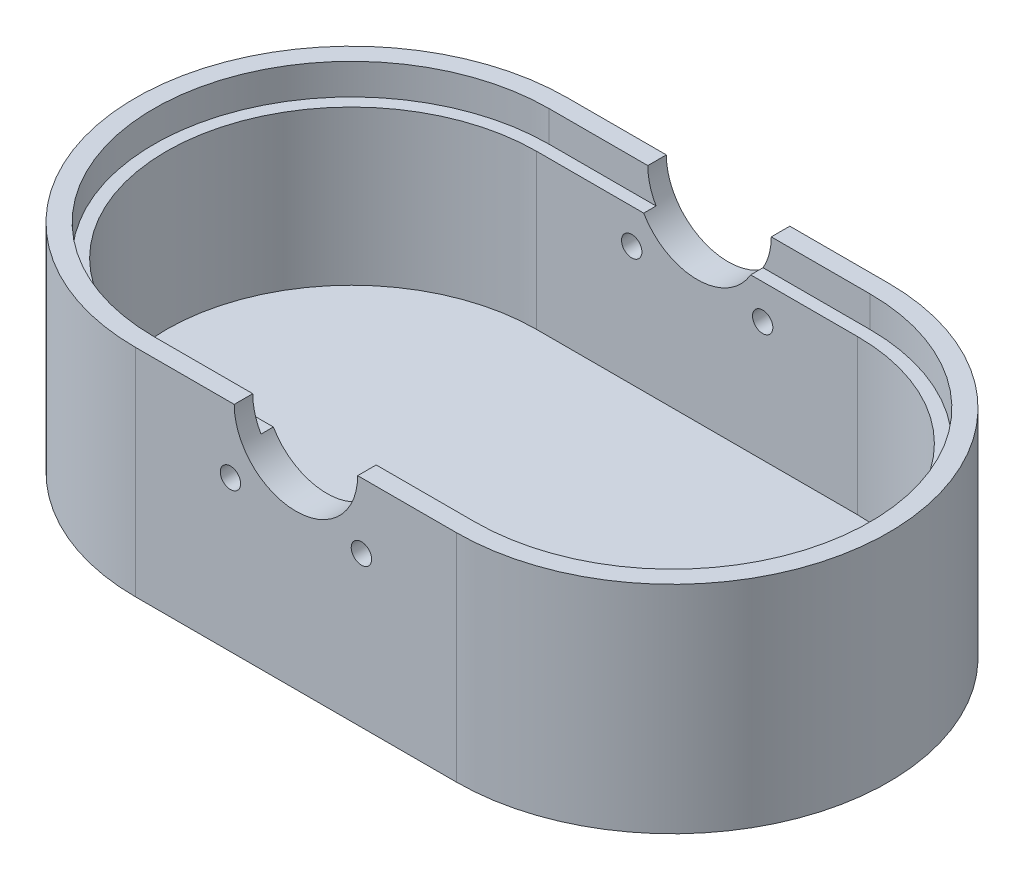
ISO-10303-21;
HEADER;
FILE_DESCRIPTION(('STEP AP214'),'2;1');
FILE_NAME('part.step','',(''),(''),'','','');
FILE_SCHEMA(('AUTOMOTIVE_DESIGN { 1 0 10303 214 1 1 1 1 }'));
ENDSEC;
DATA;
#1=APPLICATION_CONTEXT('core data for automotive mechanical design processes');
#2=APPLICATION_PROTOCOL_DEFINITION('international standard','automotive_design',2000,#1);
#3=PRODUCT_CONTEXT('',#1,'mechanical');
#4=PRODUCT('Part','Part','',(#3));
#5=PRODUCT_RELATED_PRODUCT_CATEGORY('part','',(#4));
#6=PRODUCT_DEFINITION_FORMATION('','',#4);
#7=PRODUCT_DEFINITION_CONTEXT('part definition',#1,'design');
#8=PRODUCT_DEFINITION('design','',#6,#7);
#9=PRODUCT_DEFINITION_SHAPE('','',#8);
#10=(LENGTH_UNIT() NAMED_UNIT(*) SI_UNIT(.MILLI.,.METRE.));
#11=(NAMED_UNIT(*) PLANE_ANGLE_UNIT() SI_UNIT($,.RADIAN.));
#12=(NAMED_UNIT(*) SI_UNIT($,.STERADIAN.) SOLID_ANGLE_UNIT());
#13=UNCERTAINTY_MEASURE_WITH_UNIT(LENGTH_MEASURE(1.E-05),#10,'distance_accuracy_value','');
#14=(GEOMETRIC_REPRESENTATION_CONTEXT(3) GLOBAL_UNCERTAINTY_ASSIGNED_CONTEXT((#13)) GLOBAL_UNIT_ASSIGNED_CONTEXT((#10,
#11,#12)) REPRESENTATION_CONTEXT('',''));
#15=CARTESIAN_POINT('',(0.,0.,0.));
#16=DIRECTION('',(0.,0.,1.));
#17=DIRECTION('',(1.,0.,0.));
#18=AXIS2_PLACEMENT_3D('',#15,#16,#17);
#19=CARTESIAN_POINT('',(26.,5.,0.));
#20=DIRECTION('',(0.,1.,0.));
#21=DIRECTION('',(0.,0.,1.));
#22=AXIS2_PLACEMENT_3D('',#19,#20,#21);
#23=CYLINDRICAL_SURFACE('',#22,30.);
#24=CARTESIAN_POINT('',(26.,30.,0.));
#25=DIRECTION('',(0.,1.,0.));
#26=DIRECTION('',(0.,0.,1.));
#27=AXIS2_PLACEMENT_3D('',#24,#25,#26);
#28=CIRCLE('',#27,30.);
#29=CARTESIAN_POINT('',(26.,30.,30.));
#30=VERTEX_POINT('',#29);
#31=CARTESIAN_POINT('',(26.,30.,-30.));
#32=VERTEX_POINT('',#31);
#33=EDGE_CURVE('E182',#30,#32,#28,.T.);
#34=ORIENTED_EDGE('',*,*,#33,.T.);
#35=DIRECTION('',(0.,1.,0.));
#36=VECTOR('',#35,1.);
#37=CARTESIAN_POINT('',(26.,5.,-30.));
#38=LINE('',#37,#36);
#39=CARTESIAN_POINT('',(26.,5.,-30.));
#40=VERTEX_POINT('',#39);
#41=EDGE_CURVE('E202',#40,#32,#38,.T.);
#42=ORIENTED_EDGE('',*,*,#41,.F.);
#43=CARTESIAN_POINT('',(26.,5.,0.));
#44=DIRECTION('',(0.,1.,0.));
#45=DIRECTION('',(0.,0.,1.));
#46=AXIS2_PLACEMENT_3D('',#43,#44,#45);
#47=CIRCLE('',#46,30.);
#48=CARTESIAN_POINT('',(26.,5.,30.));
#49=VERTEX_POINT('',#48);
#50=EDGE_CURVE('E286',#49,#40,#47,.T.);
#51=ORIENTED_EDGE('',*,*,#50,.F.);
#52=DIRECTION('',(0.,1.,0.));
#53=VECTOR('',#52,1.);
#54=CARTESIAN_POINT('',(26.,5.,30.));
#55=LINE('',#54,#53);
#56=EDGE_CURVE('E197',#49,#30,#55,.T.);
#57=ORIENTED_EDGE('',*,*,#56,.T.);
#58=EDGE_LOOP('',(#34,#42,#51,#57));
#59=FACE_BOUND('',#58,.T.);
#60=ADVANCED_FACE('F35',(#59),#23,.F.);
#61=CARTESIAN_POINT('',(-26.,5.,30.));
#62=DIRECTION('',(0.,0.,1.));
#63=DIRECTION('',(1.,0.,0.));
#64=AXIS2_PLACEMENT_3D('',#61,#62,#63);
#65=PLANE('',#64);
#66=CARTESIAN_POINT('',(-10.6066017177982,24.3933982822018,30.));
#67=DIRECTION('',(0.,0.,1.));
#68=DIRECTION('',(1.,0.,0.));
#69=AXIS2_PLACEMENT_3D('',#66,#67,#68);
#70=CIRCLE('',#69,1.64999999999999);
#71=CARTESIAN_POINT('',(-8.9566017177982,24.3933982822018,30.));
#72=VERTEX_POINT('',#71);
#73=EDGE_CURVE('E434',#72,#72,#70,.T.);
#74=ORIENTED_EDGE('',*,*,#73,.T.);
#75=EDGE_LOOP('',(#74));
#76=FACE_BOUND('',#75,.T.);
#77=CARTESIAN_POINT('',(10.6066017177982,24.3933982822018,30.));
#78=DIRECTION('',(0.,0.,1.));
#79=DIRECTION('',(1.,0.,0.));
#80=AXIS2_PLACEMENT_3D('',#77,#78,#79);
#81=CIRCLE('',#80,1.64999999999999);
#82=CARTESIAN_POINT('',(12.2566017177982,24.3933982822018,30.));
#83=VERTEX_POINT('',#82);
#84=EDGE_CURVE('E191',#83,#83,#81,.T.);
#85=ORIENTED_EDGE('',*,*,#84,.T.);
#86=EDGE_LOOP('',(#85));
#87=FACE_BOUND('',#86,.T.);
#88=DIRECTION('',(1.,0.,0.));
#89=VECTOR('',#88,1.);
#90=CARTESIAN_POINT('',(-26.,30.,30.));
#91=LINE('',#90,#89);
#92=CARTESIAN_POINT('',(8.66025403784438,30.,30.));
#93=VERTEX_POINT('',#92);
#94=EDGE_CURVE('E58',#93,#30,#91,.T.);
#95=ORIENTED_EDGE('',*,*,#94,.T.);
#96=ORIENTED_EDGE('',*,*,#56,.F.);
#97=DIRECTION('',(1.,0.,0.));
#98=VECTOR('',#97,1.);
#99=CARTESIAN_POINT('',(-26.,5.,30.));
#100=LINE('',#99,#98);
#101=CARTESIAN_POINT('',(-26.,5.,30.));
#102=VERTEX_POINT('',#101);
#103=EDGE_CURVE('E196',#102,#49,#100,.T.);
#104=ORIENTED_EDGE('',*,*,#103,.F.);
#105=DIRECTION('',(0.,1.,0.));
#106=VECTOR('',#105,1.);
#107=CARTESIAN_POINT('',(-26.,5.,30.));
#108=LINE('',#107,#106);
#109=CARTESIAN_POINT('',(-26.,30.,30.));
#110=VERTEX_POINT('',#109);
#111=EDGE_CURVE('E188',#102,#110,#108,.T.);
#112=ORIENTED_EDGE('',*,*,#111,.T.);
#113=CARTESIAN_POINT('',(-8.66025403784438,30.,30.));
#114=VERTEX_POINT('',#113);
#115=EDGE_CURVE('E171',#110,#114,#91,.T.);
#116=ORIENTED_EDGE('',*,*,#115,.T.);
#117=CARTESIAN_POINT('',(0.,35.,30.));
#118=DIRECTION('',(0.,0.,1.));
#119=DIRECTION('',(1.,0.,0.));
#120=AXIS2_PLACEMENT_3D('',#117,#118,#119);
#121=CIRCLE('',#120,10.);
#122=EDGE_CURVE('E274',#114,#93,#121,.T.);
#123=ORIENTED_EDGE('',*,*,#122,.T.);
#124=EDGE_LOOP('',(#95,#96,#104,#112,#116,#123));
#125=FACE_BOUND('',#124,.T.);
#126=ADVANCED_FACE('F194',(#76,#87,#125),#65,.F.);
#127=CARTESIAN_POINT('',(-26.,5.,0.));
#128=DIRECTION('',(0.,1.,0.));
#129=DIRECTION('',(0.,0.,1.));
#130=AXIS2_PLACEMENT_3D('',#127,#128,#129);
#131=CYLINDRICAL_SURFACE('',#130,30.);
#132=CARTESIAN_POINT('',(-26.,30.,0.));
#133=DIRECTION('',(0.,1.,0.));
#134=DIRECTION('',(0.,0.,1.));
#135=AXIS2_PLACEMENT_3D('',#132,#133,#134);
#136=CIRCLE('',#135,30.);
#137=CARTESIAN_POINT('',(-26.,30.,-30.));
#138=VERTEX_POINT('',#137);
#139=EDGE_CURVE('E174',#138,#110,#136,.T.);
#140=ORIENTED_EDGE('',*,*,#139,.T.);
#141=ORIENTED_EDGE('',*,*,#111,.F.);
#142=CARTESIAN_POINT('',(-26.,5.,0.));
#143=DIRECTION('',(0.,1.,0.));
#144=DIRECTION('',(0.,0.,1.));
#145=AXIS2_PLACEMENT_3D('',#142,#143,#144);
#146=CIRCLE('',#145,30.);
#147=CARTESIAN_POINT('',(-26.,5.,-30.));
#148=VERTEX_POINT('',#147);
#149=EDGE_CURVE('E292',#148,#102,#146,.T.);
#150=ORIENTED_EDGE('',*,*,#149,.F.);
#151=DIRECTION('',(0.,1.,0.));
#152=VECTOR('',#151,1.);
#153=CARTESIAN_POINT('',(-26.,5.,-30.));
#154=LINE('',#153,#152);
#155=EDGE_CURVE('E190',#148,#138,#154,.T.);
#156=ORIENTED_EDGE('',*,*,#155,.T.);
#157=EDGE_LOOP('',(#140,#141,#150,#156));
#158=FACE_BOUND('',#157,.T.);
#159=ADVANCED_FACE('F186',(#158),#131,.F.);
#160=CARTESIAN_POINT('',(26.,5.,-30.));
#161=DIRECTION('',(0.,0.,-1.));
#162=DIRECTION('',(-1.,0.,0.));
#163=AXIS2_PLACEMENT_3D('',#160,#161,#162);
#164=PLANE('',#163);
#165=CARTESIAN_POINT('',(10.6066017177982,24.3933982822018,-30.));
#166=DIRECTION('',(0.,0.,-1.));
#167=DIRECTION('',(-1.,0.,0.));
#168=AXIS2_PLACEMENT_3D('',#165,#166,#167);
#169=CIRCLE('',#168,1.64999999999999);
#170=CARTESIAN_POINT('',(8.95660171779824,24.3933982822018,-30.));
#171=VERTEX_POINT('',#170);
#172=EDGE_CURVE('E423',#171,#171,#169,.T.);
#173=ORIENTED_EDGE('',*,*,#172,.T.);
#174=EDGE_LOOP('',(#173));
#175=FACE_BOUND('',#174,.T.);
#176=CARTESIAN_POINT('',(-10.6066017177982,24.3933982822018,-30.));
#177=DIRECTION('',(0.,0.,-1.));
#178=DIRECTION('',(-1.,0.,0.));
#179=AXIS2_PLACEMENT_3D('',#176,#177,#178);
#180=CIRCLE('',#179,1.64999999999999);
#181=CARTESIAN_POINT('',(-12.2566017177982,24.3933982822018,-30.));
#182=VERTEX_POINT('',#181);
#183=EDGE_CURVE('E422',#182,#182,#180,.T.);
#184=ORIENTED_EDGE('',*,*,#183,.T.);
#185=EDGE_LOOP('',(#184));
#186=FACE_BOUND('',#185,.T.);
#187=DIRECTION('',(-1.,0.,0.));
#188=VECTOR('',#187,1.);
#189=CARTESIAN_POINT('',(26.,30.,-30.));
#190=LINE('',#189,#188);
#191=CARTESIAN_POINT('',(-8.66025403784438,30.,-30.));
#192=VERTEX_POINT('',#191);
#193=EDGE_CURVE('E300',#192,#138,#190,.T.);
#194=ORIENTED_EDGE('',*,*,#193,.T.);
#195=ORIENTED_EDGE('',*,*,#155,.F.);
#196=DIRECTION('',(-1.,0.,0.));
#197=VECTOR('',#196,1.);
#198=CARTESIAN_POINT('',(26.,5.,-30.));
#199=LINE('',#198,#197);
#200=EDGE_CURVE('E289',#40,#148,#199,.T.);
#201=ORIENTED_EDGE('',*,*,#200,.F.);
#202=ORIENTED_EDGE('',*,*,#41,.T.);
#203=CARTESIAN_POINT('',(8.66025403784438,30.,-30.));
#204=VERTEX_POINT('',#203);
#205=EDGE_CURVE('E302',#32,#204,#190,.T.);
#206=ORIENTED_EDGE('',*,*,#205,.T.);
#207=CARTESIAN_POINT('',(0.,35.,-30.));
#208=DIRECTION('',(0.,0.,-1.));
#209=DIRECTION('',(-1.,0.,0.));
#210=AXIS2_PLACEMENT_3D('',#207,#208,#209);
#211=CIRCLE('',#210,10.);
#212=EDGE_CURVE('E241',#204,#192,#211,.T.);
#213=ORIENTED_EDGE('',*,*,#212,.T.);
#214=EDGE_LOOP('',(#194,#195,#201,#202,#206,#213));
#215=FACE_BOUND('',#214,.T.);
#216=ADVANCED_FACE('F298',(#175,#186,#215),#164,.F.);
#217=CARTESIAN_POINT('',(26.,35.,0.));
#218=DIRECTION('',(0.,1.,0.));
#219=DIRECTION('',(0.,0.,1.));
#220=AXIS2_PLACEMENT_3D('',#217,#218,#219);
#221=PLANE('',#220);
#222=DIRECTION('',(-1.,0.,0.));
#223=VECTOR('',#222,1.);
#224=CARTESIAN_POINT('',(26.,35.,-32.));
#225=LINE('',#224,#223);
#226=CARTESIAN_POINT('',(-10.,35.,-32.));
#227=VERTEX_POINT('',#226);
#228=CARTESIAN_POINT('',(-26.,35.,-32.));
#229=VERTEX_POINT('',#228);
#230=EDGE_CURVE('E327',#227,#229,#225,.T.);
#231=ORIENTED_EDGE('',*,*,#230,.F.);
#232=DIRECTION('',(0.,0.,1.));
#233=VECTOR('',#232,1.);
#234=CARTESIAN_POINT('',(-10.,35.,-35.));
#235=LINE('',#234,#233);
#236=CARTESIAN_POINT('',(-10.,35.,-35.));
#237=VERTEX_POINT('',#236);
#238=EDGE_CURVE('E270',#237,#227,#235,.T.);
#239=ORIENTED_EDGE('',*,*,#238,.F.);
#240=DIRECTION('',(-1.,0.,0.));
#241=VECTOR('',#240,1.);
#242=CARTESIAN_POINT('',(-26.,35.,-35.));
#243=LINE('',#242,#241);
#244=CARTESIAN_POINT('',(-26.,35.,-35.));
#245=VERTEX_POINT('',#244);
#246=EDGE_CURVE('E211',#237,#245,#243,.T.);
#247=ORIENTED_EDGE('',*,*,#246,.T.);
#248=CARTESIAN_POINT('',(-26.,35.,0.));
#249=DIRECTION('',(0.,1.,0.));
#250=DIRECTION('',(0.,0.,1.));
#251=AXIS2_PLACEMENT_3D('',#248,#249,#250);
#252=CIRCLE('',#251,35.);
#253=CARTESIAN_POINT('',(-26.,35.,35.));
#254=VERTEX_POINT('',#253);
#255=EDGE_CURVE('E216',#245,#254,#252,.T.);
#256=ORIENTED_EDGE('',*,*,#255,.T.);
#257=DIRECTION('',(1.,0.,0.));
#258=VECTOR('',#257,1.);
#259=CARTESIAN_POINT('',(-26.,35.,35.));
#260=LINE('',#259,#258);
#261=CARTESIAN_POINT('',(-10.,35.,35.));
#262=VERTEX_POINT('',#261);
#263=EDGE_CURVE('E219',#254,#262,#260,.T.);
#264=ORIENTED_EDGE('',*,*,#263,.T.);
#265=CARTESIAN_POINT('',(-10.,35.,32.));
#266=VERTEX_POINT('',#265);
#267=EDGE_CURVE('E276',#266,#262,#235,.T.);
#268=ORIENTED_EDGE('',*,*,#267,.F.);
#269=DIRECTION('',(1.,0.,0.));
#270=VECTOR('',#269,1.);
#271=CARTESIAN_POINT('',(-26.,35.,32.));
#272=LINE('',#271,#270);
#273=CARTESIAN_POINT('',(-26.,35.,32.));
#274=VERTEX_POINT('',#273);
#275=EDGE_CURVE('E322',#274,#266,#272,.T.);
#276=ORIENTED_EDGE('',*,*,#275,.F.);
#277=CARTESIAN_POINT('',(-26.,35.,0.));
#278=DIRECTION('',(0.,1.,0.));
#279=DIRECTION('',(0.,0.,1.));
#280=AXIS2_PLACEMENT_3D('',#277,#278,#279);
#281=CIRCLE('',#280,32.);
#282=EDGE_CURVE('E304',#229,#274,#281,.T.);
#283=ORIENTED_EDGE('',*,*,#282,.F.);
#284=EDGE_LOOP('',(#231,#239,#247,#256,#264,#268,#276,#283));
#285=FACE_BOUND('',#284,.T.);
#286=ADVANCED_FACE('F348',(#285),#221,.T.);
#287=CARTESIAN_POINT('',(26.,35.,0.));
#288=DIRECTION('',(0.,-1.,0.));
#289=DIRECTION('',(0.,0.,-1.));
#290=AXIS2_PLACEMENT_3D('',#287,#288,#289);
#291=CYLINDRICAL_SURFACE('',#290,35.);
#292=CARTESIAN_POINT('',(26.,0.,0.));
#293=DIRECTION('',(0.,1.,0.));
#294=DIRECTION('',(0.,0.,1.));
#295=AXIS2_PLACEMENT_3D('',#292,#293,#294);
#296=CIRCLE('',#295,35.);
#297=CARTESIAN_POINT('',(26.,0.,35.));
#298=VERTEX_POINT('',#297);
#299=CARTESIAN_POINT('',(26.,0.,-35.));
#300=VERTEX_POINT('',#299);
#301=EDGE_CURVE('E200',#298,#300,#296,.T.);
#302=ORIENTED_EDGE('',*,*,#301,.T.);
#303=DIRECTION('',(0.,-1.,0.));
#304=VECTOR('',#303,1.);
#305=CARTESIAN_POINT('',(26.,35.,-35.));
#306=LINE('',#305,#304);
#307=CARTESIAN_POINT('',(26.,35.,-35.));
#308=VERTEX_POINT('',#307);
#309=EDGE_CURVE('E238',#308,#300,#306,.T.);
#310=ORIENTED_EDGE('',*,*,#309,.F.);
#311=CARTESIAN_POINT('',(26.,35.,0.));
#312=DIRECTION('',(0.,1.,0.));
#313=DIRECTION('',(0.,0.,1.));
#314=AXIS2_PLACEMENT_3D('',#311,#312,#313);
#315=CIRCLE('',#314,35.);
#316=CARTESIAN_POINT('',(26.,35.,35.));
#317=VERTEX_POINT('',#316);
#318=EDGE_CURVE('E208',#317,#308,#315,.T.);
#319=ORIENTED_EDGE('',*,*,#318,.F.);
#320=DIRECTION('',(0.,-1.,0.));
#321=VECTOR('',#320,1.);
#322=CARTESIAN_POINT('',(26.,35.,35.));
#323=LINE('',#322,#321);
#324=EDGE_CURVE('E222',#317,#298,#323,.T.);
#325=ORIENTED_EDGE('',*,*,#324,.T.);
#326=EDGE_LOOP('',(#302,#310,#319,#325));
#327=FACE_BOUND('',#326,.T.);
#328=ADVANCED_FACE('F37',(#327),#291,.T.);
#329=CARTESIAN_POINT('',(-26.,35.,-35.));
#330=DIRECTION('',(0.,0.,1.));
#331=DIRECTION('',(1.,0.,0.));
#332=AXIS2_PLACEMENT_3D('',#329,#330,#331);
#333=PLANE('',#332);
#334=CARTESIAN_POINT('',(10.6066017177982,24.3933982822018,-35.));
#335=DIRECTION('',(0.,0.,-1.));
#336=DIRECTION('',(-1.,0.,0.));
#337=AXIS2_PLACEMENT_3D('',#334,#335,#336);
#338=CIRCLE('',#337,1.64999999999999);
#339=CARTESIAN_POINT('',(8.95660171779825,24.3933982822018,-35.));
#340=VERTEX_POINT('',#339);
#341=EDGE_CURVE('E417',#340,#340,#338,.T.);
#342=ORIENTED_EDGE('',*,*,#341,.F.);
#343=EDGE_LOOP('',(#342));
#344=FACE_BOUND('',#343,.T.);
#345=CARTESIAN_POINT('',(-10.6066017177982,24.3933982822018,-35.));
#346=DIRECTION('',(0.,0.,-1.));
#347=DIRECTION('',(-1.,0.,0.));
#348=AXIS2_PLACEMENT_3D('',#345,#346,#347);
#349=CIRCLE('',#348,1.64999999999999);
#350=CARTESIAN_POINT('',(-12.2566017177982,24.3933982822018,-35.));
#351=VERTEX_POINT('',#350);
#352=EDGE_CURVE('E420',#351,#351,#349,.T.);
#353=ORIENTED_EDGE('',*,*,#352,.F.);
#354=EDGE_LOOP('',(#353));
#355=FACE_BOUND('',#354,.T.);
#356=ORIENTED_EDGE('',*,*,#246,.F.);
#357=CARTESIAN_POINT('',(0.,35.,-35.));
#358=DIRECTION('',(0.,0.,1.));
#359=DIRECTION('',(1.,0.,0.));
#360=AXIS2_PLACEMENT_3D('',#357,#358,#359);
#361=CIRCLE('',#360,10.);
#362=CARTESIAN_POINT('',(10.,35.,-35.));
#363=VERTEX_POINT('',#362);
#364=EDGE_CURVE('E271',#237,#363,#361,.T.);
#365=ORIENTED_EDGE('',*,*,#364,.T.);
#366=EDGE_CURVE('E213',#308,#363,#243,.T.);
#367=ORIENTED_EDGE('',*,*,#366,.F.);
#368=ORIENTED_EDGE('',*,*,#309,.T.);
#369=DIRECTION('',(-1.,0.,0.));
#370=VECTOR('',#369,1.);
#371=CARTESIAN_POINT('',(-26.,0.,-35.));
#372=LINE('',#371,#370);
#373=CARTESIAN_POINT('',(-26.,0.,-35.));
#374=VERTEX_POINT('',#373);
#375=EDGE_CURVE('E225',#300,#374,#372,.T.);
#376=ORIENTED_EDGE('',*,*,#375,.T.);
#377=DIRECTION('',(0.,-1.,0.));
#378=VECTOR('',#377,1.);
#379=CARTESIAN_POINT('',(-26.,35.,-35.));
#380=LINE('',#379,#378);
#381=EDGE_CURVE('E235',#245,#374,#380,.T.);
#382=ORIENTED_EDGE('',*,*,#381,.F.);
#383=EDGE_LOOP('',(#356,#365,#367,#368,#376,#382));
#384=FACE_BOUND('',#383,.T.);
#385=ADVANCED_FACE('F352',(#344,#355,#384),#333,.F.);
#386=CARTESIAN_POINT('',(-26.,35.,0.));
#387=DIRECTION('',(0.,-1.,0.));
#388=DIRECTION('',(0.,0.,-1.));
#389=AXIS2_PLACEMENT_3D('',#386,#387,#388);
#390=CYLINDRICAL_SURFACE('',#389,35.);
#391=CARTESIAN_POINT('',(-26.,0.,0.));
#392=DIRECTION('',(0.,1.,0.));
#393=DIRECTION('',(0.,0.,1.));
#394=AXIS2_PLACEMENT_3D('',#391,#392,#393);
#395=CIRCLE('',#394,35.);
#396=CARTESIAN_POINT('',(-26.,0.,35.));
#397=VERTEX_POINT('',#396);
#398=EDGE_CURVE('E227',#374,#397,#395,.T.);
#399=ORIENTED_EDGE('',*,*,#398,.T.);
#400=DIRECTION('',(0.,-1.,0.));
#401=VECTOR('',#400,1.);
#402=CARTESIAN_POINT('',(-26.,35.,35.));
#403=LINE('',#402,#401);
#404=EDGE_CURVE('E232',#254,#397,#403,.T.);
#405=ORIENTED_EDGE('',*,*,#404,.F.);
#406=ORIENTED_EDGE('',*,*,#255,.F.);
#407=ORIENTED_EDGE('',*,*,#381,.T.);
#408=EDGE_LOOP('',(#399,#405,#406,#407));
#409=FACE_BOUND('',#408,.T.);
#410=ADVANCED_FACE('F357',(#409),#390,.T.);
#411=CARTESIAN_POINT('',(-26.,35.,35.));
#412=DIRECTION('',(0.,0.,-1.));
#413=DIRECTION('',(-1.,0.,0.));
#414=AXIS2_PLACEMENT_3D('',#411,#412,#413);
#415=PLANE('',#414);
#416=CARTESIAN_POINT('',(-10.6066017177982,24.3933982822018,35.));
#417=DIRECTION('',(0.,0.,1.));
#418=DIRECTION('',(1.,0.,0.));
#419=AXIS2_PLACEMENT_3D('',#416,#417,#418);
#420=CIRCLE('',#419,1.64999999999999);
#421=CARTESIAN_POINT('',(-8.95660171779821,24.3933982822018,35.));
#422=VERTEX_POINT('',#421);
#423=EDGE_CURVE('E426',#422,#422,#420,.T.);
#424=ORIENTED_EDGE('',*,*,#423,.F.);
#425=EDGE_LOOP('',(#424));
#426=FACE_BOUND('',#425,.T.);
#427=CARTESIAN_POINT('',(10.6066017177982,24.3933982822018,35.));
#428=DIRECTION('',(0.,0.,1.));
#429=DIRECTION('',(1.,0.,0.));
#430=AXIS2_PLACEMENT_3D('',#427,#428,#429);
#431=CIRCLE('',#430,1.64999999999999);
#432=CARTESIAN_POINT('',(12.2566017177982,24.3933982822018,35.));
#433=VERTEX_POINT('',#432);
#434=EDGE_CURVE('E437',#433,#433,#431,.T.);
#435=ORIENTED_EDGE('',*,*,#434,.F.);
#436=EDGE_LOOP('',(#435));
#437=FACE_BOUND('',#436,.T.);
#438=CARTESIAN_POINT('',(10.,35.,35.));
#439=VERTEX_POINT('',#438);
#440=EDGE_CURVE('E218',#439,#317,#260,.T.);
#441=ORIENTED_EDGE('',*,*,#440,.F.);
#442=CARTESIAN_POINT('',(0.,35.,35.));
#443=DIRECTION('',(0.,0.,-1.));
#444=DIRECTION('',(-1.,0.,0.));
#445=AXIS2_PLACEMENT_3D('',#442,#443,#444);
#446=CIRCLE('',#445,10.);
#447=EDGE_CURVE('E281',#439,#262,#446,.T.);
#448=ORIENTED_EDGE('',*,*,#447,.T.);
#449=ORIENTED_EDGE('',*,*,#263,.F.);
#450=ORIENTED_EDGE('',*,*,#404,.T.);
#451=DIRECTION('',(1.,0.,0.));
#452=VECTOR('',#451,1.);
#453=CARTESIAN_POINT('',(-26.,0.,35.));
#454=LINE('',#453,#452);
#455=EDGE_CURVE('E212',#397,#298,#454,.T.);
#456=ORIENTED_EDGE('',*,*,#455,.T.);
#457=ORIENTED_EDGE('',*,*,#324,.F.);
#458=EDGE_LOOP('',(#441,#448,#449,#450,#456,#457));
#459=FACE_BOUND('',#458,.T.);
#460=ADVANCED_FACE('F362',(#426,#437,#459),#415,.F.);
#461=CARTESIAN_POINT('',(26.,35.,-32.));
#462=VERTEX_POINT('',#461);
#463=CARTESIAN_POINT('',(10.,35.,-32.));
#464=VERTEX_POINT('',#463);
#465=EDGE_CURVE('E269',#462,#464,#225,.T.);
#466=ORIENTED_EDGE('',*,*,#465,.F.);
#467=CARTESIAN_POINT('',(26.,35.,0.));
#468=DIRECTION('',(0.,1.,0.));
#469=DIRECTION('',(0.,0.,1.));
#470=AXIS2_PLACEMENT_3D('',#467,#468,#469);
#471=CIRCLE('',#470,32.);
#472=CARTESIAN_POINT('',(26.,35.,32.));
#473=VERTEX_POINT('',#472);
#474=EDGE_CURVE('E324',#473,#462,#471,.T.);
#475=ORIENTED_EDGE('',*,*,#474,.F.);
#476=CARTESIAN_POINT('',(9.99999999999998,35.,32.));
#477=VERTEX_POINT('',#476);
#478=EDGE_CURVE('E321',#477,#473,#272,.T.);
#479=ORIENTED_EDGE('',*,*,#478,.F.);
#480=DIRECTION('',(0.,0.,1.));
#481=VECTOR('',#480,1.);
#482=CARTESIAN_POINT('',(10.,35.,-35.));
#483=LINE('',#482,#481);
#484=EDGE_CURVE('E273',#439,#477,#483,.F.);
#485=ORIENTED_EDGE('',*,*,#484,.F.);
#486=ORIENTED_EDGE('',*,*,#440,.T.);
#487=ORIENTED_EDGE('',*,*,#318,.T.);
#488=ORIENTED_EDGE('',*,*,#366,.T.);
#489=EDGE_CURVE('E258',#464,#363,#483,.F.);
#490=ORIENTED_EDGE('',*,*,#489,.F.);
#491=EDGE_LOOP('',(#466,#475,#479,#485,#486,#487,#488,#490));
#492=FACE_BOUND('',#491,.T.);
#493=ADVANCED_FACE('F267',(#492),#221,.T.);
#494=CARTESIAN_POINT('',(26.,0.,0.));
#495=DIRECTION('',(0.,1.,0.));
#496=DIRECTION('',(0.,0.,1.));
#497=AXIS2_PLACEMENT_3D('',#494,#495,#496);
#498=PLANE('',#497);
#499=ORIENTED_EDGE('',*,*,#301,.F.);
#500=ORIENTED_EDGE('',*,*,#455,.F.);
#501=ORIENTED_EDGE('',*,*,#398,.F.);
#502=ORIENTED_EDGE('',*,*,#375,.F.);
#503=EDGE_LOOP('',(#499,#500,#501,#502));
#504=FACE_BOUND('',#503,.T.);
#505=ADVANCED_FACE('F400',(#504),#498,.F.);
#506=CARTESIAN_POINT('',(26.,5.,0.));
#507=DIRECTION('',(0.,1.,0.));
#508=DIRECTION('',(0.,0.,1.));
#509=AXIS2_PLACEMENT_3D('',#506,#507,#508);
#510=PLANE('',#509);
#511=ORIENTED_EDGE('',*,*,#50,.T.);
#512=ORIENTED_EDGE('',*,*,#200,.T.);
#513=ORIENTED_EDGE('',*,*,#149,.T.);
#514=ORIENTED_EDGE('',*,*,#103,.T.);
#515=EDGE_LOOP('',(#511,#512,#513,#514));
#516=FACE_BOUND('',#515,.T.);
#517=ADVANCED_FACE('F294',(#516),#510,.T.);
#518=CARTESIAN_POINT('',(0.,35.,-35.));
#519=DIRECTION('',(0.,0.,1.));
#520=DIRECTION('',(1.,0.,0.));
#521=AXIS2_PLACEMENT_3D('',#518,#519,#520);
#522=CYLINDRICAL_SURFACE('',#521,10.);
#523=ORIENTED_EDGE('',*,*,#238,.T.);
#524=CARTESIAN_POINT('',(0.,35.,-32.));
#525=DIRECTION('',(0.,0.,-1.));
#526=DIRECTION('',(-1.,0.,0.));
#527=AXIS2_PLACEMENT_3D('',#524,#525,#526);
#528=CIRCLE('',#527,10.);
#529=CARTESIAN_POINT('',(-8.66025403784438,30.,-32.));
#530=VERTEX_POINT('',#529);
#531=EDGE_CURVE('E11',#227,#530,#528,.F.);
#532=ORIENTED_EDGE('',*,*,#531,.T.);
#533=DIRECTION('',(0.,0.,1.));
#534=VECTOR('',#533,1.);
#535=CARTESIAN_POINT('',(-8.66025403784438,30.,-35.));
#536=LINE('',#535,#534);
#537=EDGE_CURVE('E277',#192,#530,#536,.F.);
#538=ORIENTED_EDGE('',*,*,#537,.F.);
#539=ORIENTED_EDGE('',*,*,#212,.F.);
#540=DIRECTION('',(0.,0.,1.));
#541=VECTOR('',#540,1.);
#542=CARTESIAN_POINT('',(8.66025403784438,30.,-35.));
#543=LINE('',#542,#541);
#544=CARTESIAN_POINT('',(8.66025403784438,30.,-32.));
#545=VERTEX_POINT('',#544);
#546=EDGE_CURVE('E261',#545,#204,#543,.T.);
#547=ORIENTED_EDGE('',*,*,#546,.F.);
#548=EDGE_CURVE('E39',#545,#464,#528,.F.);
#549=ORIENTED_EDGE('',*,*,#548,.T.);
#550=ORIENTED_EDGE('',*,*,#489,.T.);
#551=ORIENTED_EDGE('',*,*,#364,.F.);
#552=EDGE_LOOP('',(#523,#532,#538,#539,#547,#549,#550,#551));
#553=FACE_BOUND('',#552,.T.);
#554=ADVANCED_FACE('F257',(#553),#522,.F.);
#555=DIRECTION('',(0.,0.,1.));
#556=VECTOR('',#555,1.);
#557=CARTESIAN_POINT('',(-8.66025403784438,30.,-35.));
#558=LINE('',#557,#556);
#559=CARTESIAN_POINT('',(-8.66025403784438,30.,32.));
#560=VERTEX_POINT('',#559);
#561=EDGE_CURVE('E177',#560,#114,#558,.F.);
#562=ORIENTED_EDGE('',*,*,#561,.F.);
#563=CARTESIAN_POINT('',(0.,35.,32.));
#564=DIRECTION('',(0.,0.,1.));
#565=DIRECTION('',(1.,0.,0.));
#566=AXIS2_PLACEMENT_3D('',#563,#564,#565);
#567=CIRCLE('',#566,10.);
#568=EDGE_CURVE('E248',#560,#266,#567,.F.);
#569=ORIENTED_EDGE('',*,*,#568,.T.);
#570=ORIENTED_EDGE('',*,*,#267,.T.);
#571=ORIENTED_EDGE('',*,*,#447,.F.);
#572=ORIENTED_EDGE('',*,*,#484,.T.);
#573=CARTESIAN_POINT('',(8.66025403784437,30.,32.));
#574=VERTEX_POINT('',#573);
#575=EDGE_CURVE('E246',#477,#574,#567,.F.);
#576=ORIENTED_EDGE('',*,*,#575,.T.);
#577=DIRECTION('',(0.,0.,1.));
#578=VECTOR('',#577,1.);
#579=CARTESIAN_POINT('',(8.66025403784438,30.,-35.));
#580=LINE('',#579,#578);
#581=EDGE_CURVE('E244',#93,#574,#580,.T.);
#582=ORIENTED_EDGE('',*,*,#581,.F.);
#583=ORIENTED_EDGE('',*,*,#122,.F.);
#584=EDGE_LOOP('',(#562,#569,#570,#571,#572,#576,#582,#583));
#585=FACE_BOUND('',#584,.T.);
#586=ADVANCED_FACE('F365',(#585),#522,.F.);
#587=CARTESIAN_POINT('',(-26.,30.,0.));
#588=DIRECTION('',(0.,1.,0.));
#589=DIRECTION('',(0.,0.,1.));
#590=AXIS2_PLACEMENT_3D('',#587,#588,#589);
#591=PLANE('',#590);
#592=ORIENTED_EDGE('',*,*,#546,.T.);
#593=ORIENTED_EDGE('',*,*,#205,.F.);
#594=ORIENTED_EDGE('',*,*,#33,.F.);
#595=ORIENTED_EDGE('',*,*,#94,.F.);
#596=ORIENTED_EDGE('',*,*,#581,.T.);
#597=DIRECTION('',(1.,0.,0.));
#598=VECTOR('',#597,1.);
#599=CARTESIAN_POINT('',(-26.,30.,32.));
#600=LINE('',#599,#598);
#601=CARTESIAN_POINT('',(26.,30.,32.));
#602=VERTEX_POINT('',#601);
#603=EDGE_CURVE('E310',#574,#602,#600,.T.);
#604=ORIENTED_EDGE('',*,*,#603,.T.);
#605=CARTESIAN_POINT('',(26.,30.,0.));
#606=DIRECTION('',(0.,1.,0.));
#607=DIRECTION('',(0.,0.,1.));
#608=AXIS2_PLACEMENT_3D('',#605,#606,#607);
#609=CIRCLE('',#608,32.);
#610=CARTESIAN_POINT('',(26.,30.,-32.));
#611=VERTEX_POINT('',#610);
#612=EDGE_CURVE('E312',#602,#611,#609,.T.);
#613=ORIENTED_EDGE('',*,*,#612,.T.);
#614=DIRECTION('',(-1.,0.,0.));
#615=VECTOR('',#614,1.);
#616=CARTESIAN_POINT('',(26.,30.,-32.));
#617=LINE('',#616,#615);
#618=EDGE_CURVE('E316',#611,#545,#617,.T.);
#619=ORIENTED_EDGE('',*,*,#618,.T.);
#620=EDGE_LOOP('',(#592,#593,#594,#595,#596,#604,#613,#619));
#621=FACE_BOUND('',#620,.T.);
#622=ADVANCED_FACE('F374',(#621),#591,.T.);
#623=CARTESIAN_POINT('',(-26.,30.,32.));
#624=DIRECTION('',(0.,0.,1.));
#625=DIRECTION('',(1.,0.,0.));
#626=AXIS2_PLACEMENT_3D('',#623,#624,#625);
#627=PLANE('',#626);
#628=ORIENTED_EDGE('',*,*,#478,.T.);
#629=DIRECTION('',(0.,1.,0.));
#630=VECTOR('',#629,1.);
#631=CARTESIAN_POINT('',(26.,30.,32.));
#632=LINE('',#631,#630);
#633=EDGE_CURVE('E334',#602,#473,#632,.T.);
#634=ORIENTED_EDGE('',*,*,#633,.F.);
#635=ORIENTED_EDGE('',*,*,#603,.F.);
#636=ORIENTED_EDGE('',*,*,#575,.F.);
#637=EDGE_LOOP('',(#628,#634,#635,#636));
#638=FACE_BOUND('',#637,.T.);
#639=ADVANCED_FACE('F369',(#638),#627,.F.);
#640=CARTESIAN_POINT('',(26.,30.,-32.));
#641=DIRECTION('',(0.,0.,-1.));
#642=DIRECTION('',(-1.,0.,0.));
#643=AXIS2_PLACEMENT_3D('',#640,#641,#642);
#644=PLANE('',#643);
#645=ORIENTED_EDGE('',*,*,#618,.F.);
#646=DIRECTION('',(0.,1.,0.));
#647=VECTOR('',#646,1.);
#648=CARTESIAN_POINT('',(26.,30.,-32.));
#649=LINE('',#648,#647);
#650=EDGE_CURVE('E332',#611,#462,#649,.T.);
#651=ORIENTED_EDGE('',*,*,#650,.T.);
#652=ORIENTED_EDGE('',*,*,#465,.T.);
#653=ORIENTED_EDGE('',*,*,#548,.F.);
#654=EDGE_LOOP('',(#645,#651,#652,#653));
#655=FACE_BOUND('',#654,.T.);
#656=ADVANCED_FACE('F375',(#655),#644,.F.);
#657=CARTESIAN_POINT('',(26.,30.,0.));
#658=DIRECTION('',(0.,1.,0.));
#659=DIRECTION('',(0.,0.,1.));
#660=AXIS2_PLACEMENT_3D('',#657,#658,#659);
#661=CYLINDRICAL_SURFACE('',#660,32.);
#662=ORIENTED_EDGE('',*,*,#474,.T.);
#663=ORIENTED_EDGE('',*,*,#650,.F.);
#664=ORIENTED_EDGE('',*,*,#612,.F.);
#665=ORIENTED_EDGE('',*,*,#633,.T.);
#666=EDGE_LOOP('',(#662,#663,#664,#665));
#667=FACE_BOUND('',#666,.T.);
#668=ADVANCED_FACE('F373',(#667),#661,.F.);
#669=ORIENTED_EDGE('',*,*,#230,.T.);
#670=DIRECTION('',(0.,1.,0.));
#671=VECTOR('',#670,1.);
#672=CARTESIAN_POINT('',(-26.,30.,-32.));
#673=LINE('',#672,#671);
#674=CARTESIAN_POINT('',(-26.,30.,-32.));
#675=VERTEX_POINT('',#674);
#676=EDGE_CURVE('E329',#675,#229,#673,.T.);
#677=ORIENTED_EDGE('',*,*,#676,.F.);
#678=EDGE_CURVE('E315',#530,#675,#617,.T.);
#679=ORIENTED_EDGE('',*,*,#678,.F.);
#680=ORIENTED_EDGE('',*,*,#531,.F.);
#681=EDGE_LOOP('',(#669,#677,#679,#680));
#682=FACE_BOUND('',#681,.T.);
#683=ADVANCED_FACE('F342',(#682),#644,.F.);
#684=CARTESIAN_POINT('',(-26.,30.,32.));
#685=VERTEX_POINT('',#684);
#686=EDGE_CURVE('E50',#685,#560,#600,.T.);
#687=ORIENTED_EDGE('',*,*,#686,.F.);
#688=DIRECTION('',(0.,1.,0.));
#689=VECTOR('',#688,1.);
#690=CARTESIAN_POINT('',(-26.,30.,32.));
#691=LINE('',#690,#689);
#692=EDGE_CURVE('E318',#685,#274,#691,.T.);
#693=ORIENTED_EDGE('',*,*,#692,.T.);
#694=ORIENTED_EDGE('',*,*,#275,.T.);
#695=ORIENTED_EDGE('',*,*,#568,.F.);
#696=EDGE_LOOP('',(#687,#693,#694,#695));
#697=FACE_BOUND('',#696,.T.);
#698=ADVANCED_FACE('F384',(#697),#627,.F.);
#699=ORIENTED_EDGE('',*,*,#537,.T.);
#700=ORIENTED_EDGE('',*,*,#678,.T.);
#701=CARTESIAN_POINT('',(-26.,30.,0.));
#702=DIRECTION('',(0.,1.,0.));
#703=DIRECTION('',(0.,0.,1.));
#704=AXIS2_PLACEMENT_3D('',#701,#702,#703);
#705=CIRCLE('',#704,32.);
#706=EDGE_CURVE('E308',#675,#685,#705,.T.);
#707=ORIENTED_EDGE('',*,*,#706,.T.);
#708=ORIENTED_EDGE('',*,*,#686,.T.);
#709=ORIENTED_EDGE('',*,*,#561,.T.);
#710=ORIENTED_EDGE('',*,*,#115,.F.);
#711=ORIENTED_EDGE('',*,*,#139,.F.);
#712=ORIENTED_EDGE('',*,*,#193,.F.);
#713=EDGE_LOOP('',(#699,#700,#707,#708,#709,#710,#711,#712));
#714=FACE_BOUND('',#713,.T.);
#715=ADVANCED_FACE('F173',(#714),#591,.T.);
#716=CARTESIAN_POINT('',(-26.,30.,0.));
#717=DIRECTION('',(0.,1.,0.));
#718=DIRECTION('',(0.,0.,1.));
#719=AXIS2_PLACEMENT_3D('',#716,#717,#718);
#720=CYLINDRICAL_SURFACE('',#719,32.);
#721=ORIENTED_EDGE('',*,*,#282,.T.);
#722=ORIENTED_EDGE('',*,*,#692,.F.);
#723=ORIENTED_EDGE('',*,*,#706,.F.);
#724=ORIENTED_EDGE('',*,*,#676,.T.);
#725=EDGE_LOOP('',(#721,#722,#723,#724));
#726=FACE_BOUND('',#725,.T.);
#727=ADVANCED_FACE('F448',(#726),#720,.F.);
#728=CARTESIAN_POINT('',(10.6066017177982,24.3933982822018,35.));
#729=DIRECTION('',(0.,0.,1.));
#730=DIRECTION('',(1.,0.,0.));
#731=AXIS2_PLACEMENT_3D('',#728,#729,#730);
#732=CYLINDRICAL_SURFACE('',#731,1.64999999999999);
#733=ORIENTED_EDGE('',*,*,#84,.F.);
#734=EDGE_LOOP('',(#733));
#735=FACE_BOUND('',#734,.T.);
#736=ORIENTED_EDGE('',*,*,#434,.T.);
#737=EDGE_LOOP('',(#736));
#738=FACE_BOUND('',#737,.T.);
#739=ADVANCED_FACE('F444',(#735,#738),#732,.F.);
#740=CARTESIAN_POINT('',(-10.6066017177982,24.3933982822018,35.));
#741=DIRECTION('',(0.,0.,1.));
#742=DIRECTION('',(1.,0.,0.));
#743=AXIS2_PLACEMENT_3D('',#740,#741,#742);
#744=CYLINDRICAL_SURFACE('',#743,1.64999999999999);
#745=ORIENTED_EDGE('',*,*,#73,.F.);
#746=EDGE_LOOP('',(#745));
#747=FACE_BOUND('',#746,.T.);
#748=ORIENTED_EDGE('',*,*,#423,.T.);
#749=EDGE_LOOP('',(#748));
#750=FACE_BOUND('',#749,.T.);
#751=ADVANCED_FACE('F447',(#747,#750),#744,.F.);
#752=CARTESIAN_POINT('',(-10.6066017177982,24.3933982822018,-35.));
#753=DIRECTION('',(0.,0.,-1.));
#754=DIRECTION('',(-1.,0.,0.));
#755=AXIS2_PLACEMENT_3D('',#752,#753,#754);
#756=CYLINDRICAL_SURFACE('',#755,1.64999999999999);
#757=ORIENTED_EDGE('',*,*,#183,.F.);
#758=EDGE_LOOP('',(#757));
#759=FACE_BOUND('',#758,.T.);
#760=ORIENTED_EDGE('',*,*,#352,.T.);
#761=EDGE_LOOP('',(#760));
#762=FACE_BOUND('',#761,.T.);
#763=ADVANCED_FACE('F456',(#759,#762),#756,.F.);
#764=CARTESIAN_POINT('',(10.6066017177982,24.3933982822018,-35.));
#765=DIRECTION('',(0.,0.,-1.));
#766=DIRECTION('',(-1.,0.,0.));
#767=AXIS2_PLACEMENT_3D('',#764,#765,#766);
#768=CYLINDRICAL_SURFACE('',#767,1.64999999999999);
#769=ORIENTED_EDGE('',*,*,#172,.F.);
#770=EDGE_LOOP('',(#769));
#771=FACE_BOUND('',#770,.T.);
#772=ORIENTED_EDGE('',*,*,#341,.T.);
#773=EDGE_LOOP('',(#772));
#774=FACE_BOUND('',#773,.T.);
#775=ADVANCED_FACE('F490',(#771,#774),#768,.F.);
#776=CLOSED_SHELL('',(#60,#126,#159,#216,#286,#328,#385,#410,#460,#493,#505,#517,#554,#586,#622,
#639,#656,#668,#683,#698,#715,#727,#739,#751,#763,#775));
#777=MANIFOLD_SOLID_BREP('B2',#776);
#778=ADVANCED_BREP_SHAPE_REPRESENTATION('',(#18,#777),#14);
#779=SHAPE_DEFINITION_REPRESENTATION(#9,#778);
ENDSEC;
END-ISO-10303-21;
